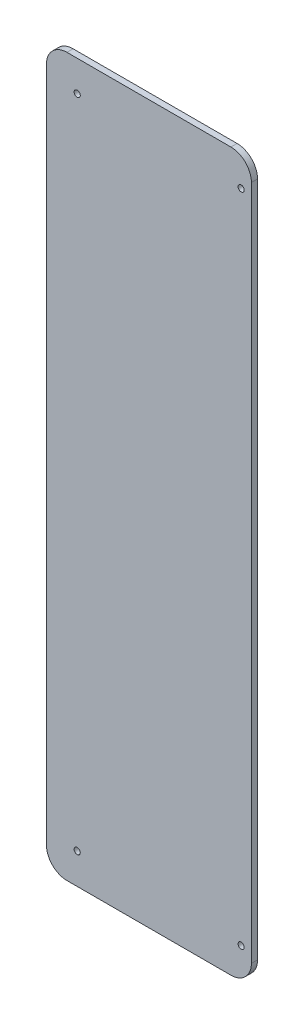
ISO-10303-21;
HEADER;
FILE_DESCRIPTION(('STEP AP214'),'2;1');
FILE_NAME('part.step','',(''),(''),'','','');
FILE_SCHEMA(('AUTOMOTIVE_DESIGN { 1 0 10303 214 1 1 1 1 }'));
ENDSEC;
DATA;
#1=APPLICATION_CONTEXT('core data for automotive mechanical design processes');
#2=APPLICATION_PROTOCOL_DEFINITION('international standard','automotive_design',2000,#1);
#3=PRODUCT_CONTEXT('',#1,'mechanical');
#4=PRODUCT('Part','Part','',(#3));
#5=PRODUCT_RELATED_PRODUCT_CATEGORY('part','',(#4));
#6=PRODUCT_DEFINITION_FORMATION('','',#4);
#7=PRODUCT_DEFINITION_CONTEXT('part definition',#1,'design');
#8=PRODUCT_DEFINITION('design','',#6,#7);
#9=PRODUCT_DEFINITION_SHAPE('','',#8);
#10=(LENGTH_UNIT() NAMED_UNIT(*) SI_UNIT(.MILLI.,.METRE.));
#11=(NAMED_UNIT(*) PLANE_ANGLE_UNIT() SI_UNIT($,.RADIAN.));
#12=(NAMED_UNIT(*) SI_UNIT($,.STERADIAN.) SOLID_ANGLE_UNIT());
#13=UNCERTAINTY_MEASURE_WITH_UNIT(LENGTH_MEASURE(1.E-05),#10,'distance_accuracy_value','');
#14=(GEOMETRIC_REPRESENTATION_CONTEXT(3) GLOBAL_UNCERTAINTY_ASSIGNED_CONTEXT((#13)) GLOBAL_UNIT_ASSIGNED_CONTEXT((#10,
#11,#12)) REPRESENTATION_CONTEXT('',''));
#15=CARTESIAN_POINT('',(0.,0.,0.));
#16=DIRECTION('',(0.,0.,1.));
#17=DIRECTION('',(1.,0.,0.));
#18=AXIS2_PLACEMENT_3D('',#15,#16,#17);
#19=CARTESIAN_POINT('',(10.,10.,3.));
#20=DIRECTION('',(0.,0.,-1.));
#21=DIRECTION('',(-1.,0.,0.));
#22=AXIS2_PLACEMENT_3D('',#19,#20,#21);
#23=PLANE('',#22);
#24=CARTESIAN_POINT('',(10.,10.,3.));
#25=DIRECTION('',(0.,0.,1.));
#26=DIRECTION('',(-1.,0.,0.));
#27=AXIS2_PLACEMENT_3D('',#24,#25,#26);
#28=CIRCLE('',#27,10.);
#29=CARTESIAN_POINT('',(0.,10.0000000000001,3.));
#30=VERTEX_POINT('',#29);
#31=CARTESIAN_POINT('',(10.0000000000001,0.,3.));
#32=VERTEX_POINT('',#31);
#33=EDGE_CURVE('E144',#30,#32,#28,.T.);
#34=ORIENTED_EDGE('',*,*,#33,.T.);
#35=DIRECTION('',(1.,0.,0.));
#36=VECTOR('',#35,1.);
#37=CARTESIAN_POINT('',(10.0000000000001,0.,3.));
#38=LINE('',#37,#36);
#39=CARTESIAN_POINT('',(89.9999999999999,0.,3.));
#40=VERTEX_POINT('',#39);
#41=EDGE_CURVE('E92',#32,#40,#38,.T.);
#42=ORIENTED_EDGE('',*,*,#41,.T.);
#43=CARTESIAN_POINT('',(90.,10.,3.));
#44=DIRECTION('',(0.,0.,1.));
#45=DIRECTION('',(1.,0.,0.));
#46=AXIS2_PLACEMENT_3D('',#43,#44,#45);
#47=CIRCLE('',#46,10.);
#48=CARTESIAN_POINT('',(100.,10.,3.));
#49=VERTEX_POINT('',#48);
#50=EDGE_CURVE('E159',#40,#49,#47,.T.);
#51=ORIENTED_EDGE('',*,*,#50,.T.);
#52=DIRECTION('',(0.,1.,0.));
#53=VECTOR('',#52,1.);
#54=CARTESIAN_POINT('',(100.,10.0000000000001,3.));
#55=LINE('',#54,#53);
#56=CARTESIAN_POINT('',(100.,340.,3.));
#57=VERTEX_POINT('',#56);
#58=EDGE_CURVE('E172',#49,#57,#55,.T.);
#59=ORIENTED_EDGE('',*,*,#58,.T.);
#60=CARTESIAN_POINT('',(90.,340.,3.));
#61=DIRECTION('',(0.,0.,1.));
#62=DIRECTION('',(-1.,0.,0.));
#63=AXIS2_PLACEMENT_3D('',#60,#61,#62);
#64=CIRCLE('',#63,10.);
#65=CARTESIAN_POINT('',(89.9999999999999,350.,3.));
#66=VERTEX_POINT('',#65);
#67=EDGE_CURVE('E111',#57,#66,#64,.T.);
#68=ORIENTED_EDGE('',*,*,#67,.T.);
#69=DIRECTION('',(-1.,0.,0.));
#70=VECTOR('',#69,1.);
#71=CARTESIAN_POINT('',(10.0000000000001,350.,3.));
#72=LINE('',#71,#70);
#73=CARTESIAN_POINT('',(10.0000000000001,350.,3.));
#74=VERTEX_POINT('',#73);
#75=EDGE_CURVE('E105',#66,#74,#72,.T.);
#76=ORIENTED_EDGE('',*,*,#75,.T.);
#77=CARTESIAN_POINT('',(10.,340.,3.));
#78=DIRECTION('',(0.,0.,1.));
#79=DIRECTION('',(-1.,0.,0.));
#80=AXIS2_PLACEMENT_3D('',#77,#78,#79);
#81=CIRCLE('',#80,10.);
#82=CARTESIAN_POINT('',(0.,340.,3.));
#83=VERTEX_POINT('',#82);
#84=EDGE_CURVE('E109',#74,#83,#81,.T.);
#85=ORIENTED_EDGE('',*,*,#84,.T.);
#86=DIRECTION('',(0.,-1.,0.));
#87=VECTOR('',#86,1.);
#88=CARTESIAN_POINT('',(0.,10.0000000000001,3.));
#89=LINE('',#88,#87);
#90=EDGE_CURVE('E49',#83,#30,#89,.T.);
#91=ORIENTED_EDGE('',*,*,#90,.T.);
#92=EDGE_LOOP('',(#34,#42,#51,#59,#68,#76,#85,#91));
#93=FACE_BOUND('',#92,.T.);
#94=CARTESIAN_POINT('',(95.,335.,3.));
#95=DIRECTION('',(0.,0.,1.));
#96=DIRECTION('',(1.,0.,0.));
#97=AXIS2_PLACEMENT_3D('',#94,#95,#96);
#98=CIRCLE('',#97,1.5);
#99=CARTESIAN_POINT('',(96.5,335.,3.));
#100=VERTEX_POINT('',#99);
#101=EDGE_CURVE('E133',#100,#100,#98,.T.);
#102=ORIENTED_EDGE('',*,*,#101,.F.);
#103=EDGE_LOOP('',(#102));
#104=FACE_BOUND('',#103,.T.);
#105=CARTESIAN_POINT('',(15.,335.,3.));
#106=DIRECTION('',(0.,0.,1.));
#107=DIRECTION('',(1.,0.,0.));
#108=AXIS2_PLACEMENT_3D('',#105,#106,#107);
#109=CIRCLE('',#108,1.5);
#110=CARTESIAN_POINT('',(16.5,335.,3.));
#111=VERTEX_POINT('',#110);
#112=EDGE_CURVE('E181',#111,#111,#109,.T.);
#113=ORIENTED_EDGE('',*,*,#112,.F.);
#114=EDGE_LOOP('',(#113));
#115=FACE_BOUND('',#114,.T.);
#116=CARTESIAN_POINT('',(95.,15.,3.));
#117=DIRECTION('',(0.,0.,1.));
#118=DIRECTION('',(1.,0.,0.));
#119=AXIS2_PLACEMENT_3D('',#116,#117,#118);
#120=CIRCLE('',#119,1.5);
#121=CARTESIAN_POINT('',(96.5,15.,3.));
#122=VERTEX_POINT('',#121);
#123=EDGE_CURVE('E187',#122,#122,#120,.T.);
#124=ORIENTED_EDGE('',*,*,#123,.F.);
#125=EDGE_LOOP('',(#124));
#126=FACE_BOUND('',#125,.T.);
#127=CARTESIAN_POINT('',(15.,15.,3.));
#128=DIRECTION('',(0.,0.,1.));
#129=DIRECTION('',(1.,0.,0.));
#130=AXIS2_PLACEMENT_3D('',#127,#128,#129);
#131=CIRCLE('',#130,1.5);
#132=CARTESIAN_POINT('',(16.5,15.,3.));
#133=VERTEX_POINT('',#132);
#134=EDGE_CURVE('E193',#133,#133,#131,.T.);
#135=ORIENTED_EDGE('',*,*,#134,.F.);
#136=EDGE_LOOP('',(#135));
#137=FACE_BOUND('',#136,.T.);
#138=ADVANCED_FACE('F32',(#93,#104,#115,#126,#137),#23,.F.);
#139=CARTESIAN_POINT('',(10.,10.,0.));
#140=DIRECTION('',(0.,0.,-1.));
#141=DIRECTION('',(-1.,0.,0.));
#142=AXIS2_PLACEMENT_3D('',#139,#140,#141);
#143=PLANE('',#142);
#144=CARTESIAN_POINT('',(95.,15.,0.));
#145=DIRECTION('',(0.,0.,1.));
#146=DIRECTION('',(1.,0.,0.));
#147=AXIS2_PLACEMENT_3D('',#144,#145,#146);
#148=CIRCLE('',#147,1.5);
#149=CARTESIAN_POINT('',(96.5,15.,0.));
#150=VERTEX_POINT('',#149);
#151=EDGE_CURVE('E190',#150,#150,#148,.T.);
#152=ORIENTED_EDGE('',*,*,#151,.T.);
#153=EDGE_LOOP('',(#152));
#154=FACE_BOUND('',#153,.T.);
#155=CARTESIAN_POINT('',(95.,335.,0.));
#156=DIRECTION('',(0.,0.,1.));
#157=DIRECTION('',(1.,0.,0.));
#158=AXIS2_PLACEMENT_3D('',#155,#156,#157);
#159=CIRCLE('',#158,1.5);
#160=CARTESIAN_POINT('',(96.5,335.,0.));
#161=VERTEX_POINT('',#160);
#162=EDGE_CURVE('E178',#161,#161,#159,.T.);
#163=ORIENTED_EDGE('',*,*,#162,.T.);
#164=EDGE_LOOP('',(#163));
#165=FACE_BOUND('',#164,.T.);
#166=CARTESIAN_POINT('',(10.,10.,0.));
#167=DIRECTION('',(0.,0.,1.));
#168=DIRECTION('',(-1.,0.,0.));
#169=AXIS2_PLACEMENT_3D('',#166,#167,#168);
#170=CIRCLE('',#169,10.);
#171=CARTESIAN_POINT('',(0.,10.0000000000001,0.));
#172=VERTEX_POINT('',#171);
#173=CARTESIAN_POINT('',(10.0000000000001,0.,0.));
#174=VERTEX_POINT('',#173);
#175=EDGE_CURVE('E129',#172,#174,#170,.T.);
#176=ORIENTED_EDGE('',*,*,#175,.F.);
#177=DIRECTION('',(0.,-1.,0.));
#178=VECTOR('',#177,1.);
#179=CARTESIAN_POINT('',(0.,10.0000000000001,0.));
#180=LINE('',#179,#178);
#181=CARTESIAN_POINT('',(0.,340.,0.));
#182=VERTEX_POINT('',#181);
#183=EDGE_CURVE('E84',#182,#172,#180,.T.);
#184=ORIENTED_EDGE('',*,*,#183,.F.);
#185=CARTESIAN_POINT('',(10.,340.,0.));
#186=DIRECTION('',(0.,0.,1.));
#187=DIRECTION('',(-1.,0.,0.));
#188=AXIS2_PLACEMENT_3D('',#185,#186,#187);
#189=CIRCLE('',#188,10.);
#190=CARTESIAN_POINT('',(10.0000000000001,350.,0.));
#191=VERTEX_POINT('',#190);
#192=EDGE_CURVE('E78',#191,#182,#189,.T.);
#193=ORIENTED_EDGE('',*,*,#192,.F.);
#194=DIRECTION('',(-1.,0.,0.));
#195=VECTOR('',#194,1.);
#196=CARTESIAN_POINT('',(10.0000000000001,350.,0.));
#197=LINE('',#196,#195);
#198=CARTESIAN_POINT('',(89.9999999999999,350.,0.));
#199=VERTEX_POINT('',#198);
#200=EDGE_CURVE('E119',#199,#191,#197,.T.);
#201=ORIENTED_EDGE('',*,*,#200,.F.);
#202=CARTESIAN_POINT('',(90.,340.,0.));
#203=DIRECTION('',(0.,0.,1.));
#204=DIRECTION('',(-1.,0.,0.));
#205=AXIS2_PLACEMENT_3D('',#202,#203,#204);
#206=CIRCLE('',#205,10.);
#207=CARTESIAN_POINT('',(100.,340.,0.));
#208=VERTEX_POINT('',#207);
#209=EDGE_CURVE('E139',#208,#199,#206,.T.);
#210=ORIENTED_EDGE('',*,*,#209,.F.);
#211=DIRECTION('',(0.,1.,0.));
#212=VECTOR('',#211,1.);
#213=CARTESIAN_POINT('',(100.,10.0000000000001,0.));
#214=LINE('',#213,#212);
#215=CARTESIAN_POINT('',(100.,10.,0.));
#216=VERTEX_POINT('',#215);
#217=EDGE_CURVE('E137',#216,#208,#214,.T.);
#218=ORIENTED_EDGE('',*,*,#217,.F.);
#219=CARTESIAN_POINT('',(90.,10.,0.));
#220=DIRECTION('',(0.,0.,1.));
#221=DIRECTION('',(1.,0.,0.));
#222=AXIS2_PLACEMENT_3D('',#219,#220,#221);
#223=CIRCLE('',#222,10.);
#224=CARTESIAN_POINT('',(89.9999999999999,0.,0.));
#225=VERTEX_POINT('',#224);
#226=EDGE_CURVE('E135',#225,#216,#223,.T.);
#227=ORIENTED_EDGE('',*,*,#226,.F.);
#228=DIRECTION('',(1.,0.,0.));
#229=VECTOR('',#228,1.);
#230=CARTESIAN_POINT('',(10.0000000000001,0.,0.));
#231=LINE('',#230,#229);
#232=EDGE_CURVE('E132',#174,#225,#231,.T.);
#233=ORIENTED_EDGE('',*,*,#232,.F.);
#234=EDGE_LOOP('',(#176,#184,#193,#201,#210,#218,#227,#233));
#235=FACE_BOUND('',#234,.T.);
#236=CARTESIAN_POINT('',(15.,335.,0.));
#237=DIRECTION('',(0.,0.,1.));
#238=DIRECTION('',(1.,0.,0.));
#239=AXIS2_PLACEMENT_3D('',#236,#237,#238);
#240=CIRCLE('',#239,1.5);
#241=CARTESIAN_POINT('',(16.5,335.,0.));
#242=VERTEX_POINT('',#241);
#243=EDGE_CURVE('E184',#242,#242,#240,.T.);
#244=ORIENTED_EDGE('',*,*,#243,.T.);
#245=EDGE_LOOP('',(#244));
#246=FACE_BOUND('',#245,.T.);
#247=CARTESIAN_POINT('',(15.,15.,0.));
#248=DIRECTION('',(0.,0.,1.));
#249=DIRECTION('',(1.,0.,0.));
#250=AXIS2_PLACEMENT_3D('',#247,#248,#249);
#251=CIRCLE('',#250,1.5);
#252=CARTESIAN_POINT('',(16.5,15.,0.));
#253=VERTEX_POINT('',#252);
#254=EDGE_CURVE('E196',#253,#253,#251,.T.);
#255=ORIENTED_EDGE('',*,*,#254,.T.);
#256=EDGE_LOOP('',(#255));
#257=FACE_BOUND('',#256,.T.);
#258=ADVANCED_FACE('F163',(#154,#165,#235,#246,#257),#143,.T.);
#259=CARTESIAN_POINT('',(10.,10.,3.));
#260=DIRECTION('',(0.,0.,-1.));
#261=DIRECTION('',(-1.,0.,0.));
#262=AXIS2_PLACEMENT_3D('',#259,#260,#261);
#263=CYLINDRICAL_SURFACE('',#262,10.);
#264=ORIENTED_EDGE('',*,*,#175,.T.);
#265=DIRECTION('',(0.,0.,-1.));
#266=VECTOR('',#265,1.);
#267=CARTESIAN_POINT('',(10.0000000000001,0.,3.));
#268=LINE('',#267,#266);
#269=EDGE_CURVE('E11',#32,#174,#268,.T.);
#270=ORIENTED_EDGE('',*,*,#269,.F.);
#271=ORIENTED_EDGE('',*,*,#33,.F.);
#272=DIRECTION('',(0.,0.,-1.));
#273=VECTOR('',#272,1.);
#274=CARTESIAN_POINT('',(0.,10.0000000000001,3.));
#275=LINE('',#274,#273);
#276=EDGE_CURVE('E125',#30,#172,#275,.T.);
#277=ORIENTED_EDGE('',*,*,#276,.T.);
#278=EDGE_LOOP('',(#264,#270,#271,#277));
#279=FACE_BOUND('',#278,.T.);
#280=ADVANCED_FACE('F34',(#279),#263,.T.);
#281=CARTESIAN_POINT('',(10.0000000000001,0.,3.));
#282=DIRECTION('',(0.,1.,0.));
#283=DIRECTION('',(0.,0.,1.));
#284=AXIS2_PLACEMENT_3D('',#281,#282,#283);
#285=PLANE('',#284);
#286=ORIENTED_EDGE('',*,*,#232,.T.);
#287=DIRECTION('',(0.,0.,-1.));
#288=VECTOR('',#287,1.);
#289=CARTESIAN_POINT('',(89.9999999999999,0.,3.));
#290=LINE('',#289,#288);
#291=EDGE_CURVE('E41',#40,#225,#290,.T.);
#292=ORIENTED_EDGE('',*,*,#291,.F.);
#293=ORIENTED_EDGE('',*,*,#41,.F.);
#294=ORIENTED_EDGE('',*,*,#269,.T.);
#295=EDGE_LOOP('',(#286,#292,#293,#294));
#296=FACE_BOUND('',#295,.T.);
#297=ADVANCED_FACE('F228',(#296),#285,.F.);
#298=CARTESIAN_POINT('',(90.,10.,3.));
#299=DIRECTION('',(0.,0.,-1.));
#300=DIRECTION('',(-1.,0.,0.));
#301=AXIS2_PLACEMENT_3D('',#298,#299,#300);
#302=CYLINDRICAL_SURFACE('',#301,10.);
#303=ORIENTED_EDGE('',*,*,#226,.T.);
#304=DIRECTION('',(0.,0.,-1.));
#305=VECTOR('',#304,1.);
#306=CARTESIAN_POINT('',(100.,10.,3.));
#307=LINE('',#306,#305);
#308=EDGE_CURVE('E151',#49,#216,#307,.T.);
#309=ORIENTED_EDGE('',*,*,#308,.F.);
#310=ORIENTED_EDGE('',*,*,#50,.F.);
#311=ORIENTED_EDGE('',*,*,#291,.T.);
#312=EDGE_LOOP('',(#303,#309,#310,#311));
#313=FACE_BOUND('',#312,.T.);
#314=ADVANCED_FACE('F157',(#313),#302,.T.);
#315=CARTESIAN_POINT('',(100.,10.0000000000001,3.));
#316=DIRECTION('',(-1.,0.,0.));
#317=DIRECTION('',(0.,0.,1.));
#318=AXIS2_PLACEMENT_3D('',#315,#316,#317);
#319=PLANE('',#318);
#320=ORIENTED_EDGE('',*,*,#217,.T.);
#321=DIRECTION('',(0.,0.,-1.));
#322=VECTOR('',#321,1.);
#323=CARTESIAN_POINT('',(100.,340.,3.));
#324=LINE('',#323,#322);
#325=EDGE_CURVE('E148',#57,#208,#324,.T.);
#326=ORIENTED_EDGE('',*,*,#325,.F.);
#327=ORIENTED_EDGE('',*,*,#58,.F.);
#328=ORIENTED_EDGE('',*,*,#308,.T.);
#329=EDGE_LOOP('',(#320,#326,#327,#328));
#330=FACE_BOUND('',#329,.T.);
#331=ADVANCED_FACE('F168',(#330),#319,.F.);
#332=CARTESIAN_POINT('',(90.,340.,3.));
#333=DIRECTION('',(0.,0.,-1.));
#334=DIRECTION('',(-1.,0.,0.));
#335=AXIS2_PLACEMENT_3D('',#332,#333,#334);
#336=CYLINDRICAL_SURFACE('',#335,10.);
#337=ORIENTED_EDGE('',*,*,#209,.T.);
#338=DIRECTION('',(0.,0.,-1.));
#339=VECTOR('',#338,1.);
#340=CARTESIAN_POINT('',(89.9999999999999,350.,3.));
#341=LINE('',#340,#339);
#342=EDGE_CURVE('E120',#66,#199,#341,.T.);
#343=ORIENTED_EDGE('',*,*,#342,.F.);
#344=ORIENTED_EDGE('',*,*,#67,.F.);
#345=ORIENTED_EDGE('',*,*,#325,.T.);
#346=EDGE_LOOP('',(#337,#343,#344,#345));
#347=FACE_BOUND('',#346,.T.);
#348=ADVANCED_FACE('F171',(#347),#336,.T.);
#349=CARTESIAN_POINT('',(10.0000000000001,350.,3.));
#350=DIRECTION('',(0.,-1.,0.));
#351=DIRECTION('',(0.,0.,-1.));
#352=AXIS2_PLACEMENT_3D('',#349,#350,#351);
#353=PLANE('',#352);
#354=ORIENTED_EDGE('',*,*,#200,.T.);
#355=DIRECTION('',(0.,0.,-1.));
#356=VECTOR('',#355,1.);
#357=CARTESIAN_POINT('',(10.0000000000001,350.,3.));
#358=LINE('',#357,#356);
#359=EDGE_CURVE('E116',#74,#191,#358,.T.);
#360=ORIENTED_EDGE('',*,*,#359,.F.);
#361=ORIENTED_EDGE('',*,*,#75,.F.);
#362=ORIENTED_EDGE('',*,*,#342,.T.);
#363=EDGE_LOOP('',(#354,#360,#361,#362));
#364=FACE_BOUND('',#363,.T.);
#365=ADVANCED_FACE('F117',(#364),#353,.F.);
#366=CARTESIAN_POINT('',(10.,340.,3.));
#367=DIRECTION('',(0.,0.,-1.));
#368=DIRECTION('',(-1.,0.,0.));
#369=AXIS2_PLACEMENT_3D('',#366,#367,#368);
#370=CYLINDRICAL_SURFACE('',#369,10.);
#371=ORIENTED_EDGE('',*,*,#192,.T.);
#372=DIRECTION('',(0.,0.,-1.));
#373=VECTOR('',#372,1.);
#374=CARTESIAN_POINT('',(0.,340.,3.));
#375=LINE('',#374,#373);
#376=EDGE_CURVE('E121',#83,#182,#375,.T.);
#377=ORIENTED_EDGE('',*,*,#376,.F.);
#378=ORIENTED_EDGE('',*,*,#84,.F.);
#379=ORIENTED_EDGE('',*,*,#359,.T.);
#380=EDGE_LOOP('',(#371,#377,#378,#379));
#381=FACE_BOUND('',#380,.T.);
#382=ADVANCED_FACE('F123',(#381),#370,.T.);
#383=CARTESIAN_POINT('',(0.,10.0000000000001,3.));
#384=DIRECTION('',(1.,0.,0.));
#385=DIRECTION('',(0.,0.,-1.));
#386=AXIS2_PLACEMENT_3D('',#383,#384,#385);
#387=PLANE('',#386);
#388=ORIENTED_EDGE('',*,*,#183,.T.);
#389=ORIENTED_EDGE('',*,*,#276,.F.);
#390=ORIENTED_EDGE('',*,*,#90,.F.);
#391=ORIENTED_EDGE('',*,*,#376,.T.);
#392=EDGE_LOOP('',(#388,#389,#390,#391));
#393=FACE_BOUND('',#392,.T.);
#394=ADVANCED_FACE('F216',(#393),#387,.F.);
#395=CARTESIAN_POINT('',(95.,335.,3.));
#396=DIRECTION('',(0.,0.,-1.));
#397=DIRECTION('',(-1.,0.,0.));
#398=AXIS2_PLACEMENT_3D('',#395,#396,#397);
#399=CYLINDRICAL_SURFACE('',#398,1.5);
#400=ORIENTED_EDGE('',*,*,#101,.T.);
#401=EDGE_LOOP('',(#400));
#402=FACE_BOUND('',#401,.T.);
#403=ORIENTED_EDGE('',*,*,#162,.F.);
#404=EDGE_LOOP('',(#403));
#405=FACE_BOUND('',#404,.T.);
#406=ADVANCED_FACE('F213',(#402,#405),#399,.F.);
#407=CARTESIAN_POINT('',(15.,335.,3.));
#408=DIRECTION('',(0.,0.,-1.));
#409=DIRECTION('',(-1.,0.,0.));
#410=AXIS2_PLACEMENT_3D('',#407,#408,#409);
#411=CYLINDRICAL_SURFACE('',#410,1.5);
#412=ORIENTED_EDGE('',*,*,#112,.T.);
#413=EDGE_LOOP('',(#412));
#414=FACE_BOUND('',#413,.T.);
#415=ORIENTED_EDGE('',*,*,#243,.F.);
#416=EDGE_LOOP('',(#415));
#417=FACE_BOUND('',#416,.T.);
#418=ADVANCED_FACE('F292',(#414,#417),#411,.F.);
#419=CARTESIAN_POINT('',(95.,15.,3.));
#420=DIRECTION('',(0.,0.,-1.));
#421=DIRECTION('',(-1.,0.,0.));
#422=AXIS2_PLACEMENT_3D('',#419,#420,#421);
#423=CYLINDRICAL_SURFACE('',#422,1.5);
#424=ORIENTED_EDGE('',*,*,#123,.T.);
#425=EDGE_LOOP('',(#424));
#426=FACE_BOUND('',#425,.T.);
#427=ORIENTED_EDGE('',*,*,#151,.F.);
#428=EDGE_LOOP('',(#427));
#429=FACE_BOUND('',#428,.T.);
#430=ADVANCED_FACE('F300',(#426,#429),#423,.F.);
#431=CARTESIAN_POINT('',(15.,15.,3.));
#432=DIRECTION('',(0.,0.,-1.));
#433=DIRECTION('',(-1.,0.,0.));
#434=AXIS2_PLACEMENT_3D('',#431,#432,#433);
#435=CYLINDRICAL_SURFACE('',#434,1.5);
#436=ORIENTED_EDGE('',*,*,#134,.T.);
#437=EDGE_LOOP('',(#436));
#438=FACE_BOUND('',#437,.T.);
#439=ORIENTED_EDGE('',*,*,#254,.F.);
#440=EDGE_LOOP('',(#439));
#441=FACE_BOUND('',#440,.T.);
#442=ADVANCED_FACE('F202',(#438,#441),#435,.F.);
#443=CLOSED_SHELL('',(#138,#258,#280,#297,#314,#331,#348,#365,#382,#394,#406,#418,#430,#442));
#444=MANIFOLD_SOLID_BREP('B2',#443);
#445=ADVANCED_BREP_SHAPE_REPRESENTATION('',(#18,#444),#14);
#446=SHAPE_DEFINITION_REPRESENTATION(#9,#445);
ENDSEC;
END-ISO-10303-21;
